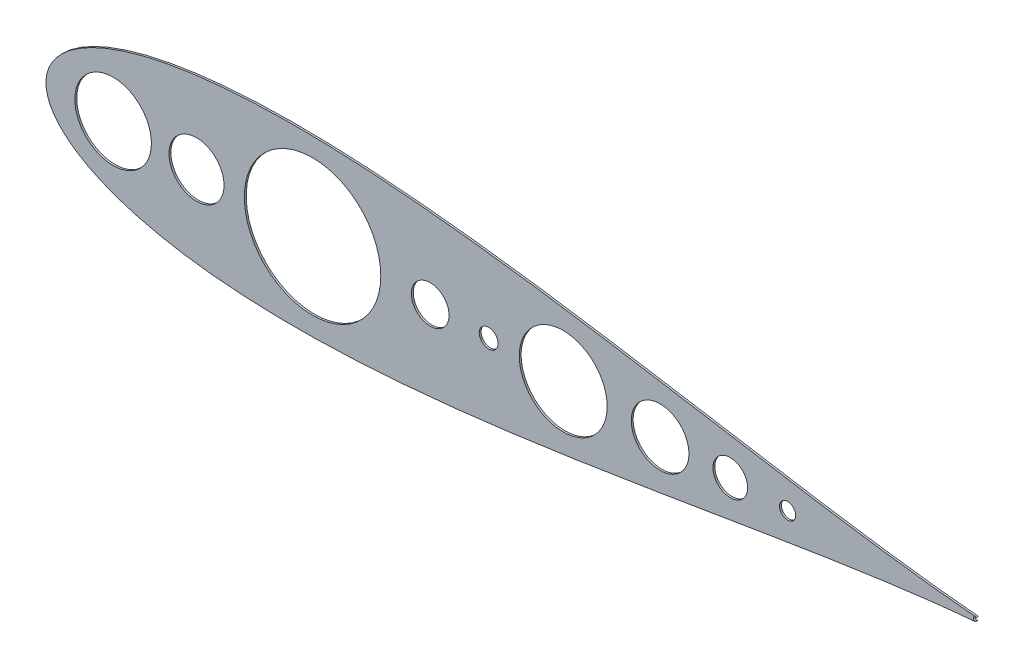
ISO-10303-21;
HEADER;
FILE_DESCRIPTION(('STEP AP214'),'2;1');
FILE_NAME('part.step','',(''),(''),'','','');
FILE_SCHEMA(('AUTOMOTIVE_DESIGN { 1 0 10303 214 1 1 1 1 }'));
ENDSEC;
DATA;
#1=APPLICATION_CONTEXT('core data for automotive mechanical design processes');
#2=APPLICATION_PROTOCOL_DEFINITION('international standard','automotive_design',2000,#1);
#3=PRODUCT_CONTEXT('',#1,'mechanical');
#4=PRODUCT('Part','Part','',(#3));
#5=PRODUCT_RELATED_PRODUCT_CATEGORY('part','',(#4));
#6=PRODUCT_DEFINITION_FORMATION('','',#4);
#7=PRODUCT_DEFINITION_CONTEXT('part definition',#1,'design');
#8=PRODUCT_DEFINITION('design','',#6,#7);
#9=PRODUCT_DEFINITION_SHAPE('','',#8);
#10=(LENGTH_UNIT() NAMED_UNIT(*) SI_UNIT(.MILLI.,.METRE.));
#11=(NAMED_UNIT(*) PLANE_ANGLE_UNIT() SI_UNIT($,.RADIAN.));
#12=(NAMED_UNIT(*) SI_UNIT($,.STERADIAN.) SOLID_ANGLE_UNIT());
#13=UNCERTAINTY_MEASURE_WITH_UNIT(LENGTH_MEASURE(1.E-05),#10,'distance_accuracy_value','');
#14=(GEOMETRIC_REPRESENTATION_CONTEXT(3) GLOBAL_UNCERTAINTY_ASSIGNED_CONTEXT((#13)) GLOBAL_UNIT_ASSIGNED_CONTEXT((#10,
#11,#12)) REPRESENTATION_CONTEXT('',''));
#15=CARTESIAN_POINT('',(0.,0.,0.));
#16=DIRECTION('',(0.,0.,1.));
#17=DIRECTION('',(1.,0.,0.));
#18=AXIS2_PLACEMENT_3D('',#15,#16,#17);
#19=CARTESIAN_POINT('',(500.049305034612,1063.59000346621,2.54));
#20=DIRECTION('',(0.,0.,1.));
#21=DIRECTION('',(1.,0.,0.));
#22=AXIS2_PLACEMENT_3D('',#19,#20,#21);
#23=PLANE('',#22);
#24=CARTESIAN_POINT('',(1422.27175930144,1063.5900034736,2.54));
#25=DIRECTION('',(0.,0.,1.));
#26=DIRECTION('',(1.,0.,0.));
#27=AXIS2_PLACEMENT_3D('',#24,#25,#26);
#28=CIRCLE('',#27,23.3714748823286);
#29=CARTESIAN_POINT('',(1445.64323418377,1063.5900034736,2.54));
#30=VERTEX_POINT('',#29);
#31=EDGE_CURVE('E162',#30,#30,#28,.T.);
#32=ORIENTED_EDGE('',*,*,#31,.F.);
#33=EDGE_LOOP('',(#32));
#34=FACE_BOUND('',#33,.T.);
#35=CARTESIAN_POINT('',(1499.51967033744,1063.5900034736,2.54));
#36=DIRECTION('',(0.,0.,1.));
#37=DIRECTION('',(1.,0.,0.));
#38=AXIS2_PLACEMENT_3D('',#35,#36,#37);
#39=CIRCLE('',#38,10.8856480660851);
#40=CARTESIAN_POINT('',(1510.40531840352,1063.5900034736,2.54));
#41=VERTEX_POINT('',#40);
#42=EDGE_CURVE('E150',#41,#41,#39,.T.);
#43=ORIENTED_EDGE('',*,*,#42,.F.);
#44=EDGE_LOOP('',(#43));
#45=FACE_BOUND('',#44,.T.);
#46=CARTESIAN_POINT('',(1197.11761222176,1063.5900034736,2.54));
#47=DIRECTION('',(0.,0.,1.));
#48=DIRECTION('',(1.,0.,0.));
#49=AXIS2_PLACEMENT_3D('',#46,#47,#48);
#50=CIRCLE('',#49,59.2339025280717);
#51=CARTESIAN_POINT('',(1256.35151474983,1063.5900034736,2.54));
#52=VERTEX_POINT('',#51);
#53=EDGE_CURVE('E138',#52,#52,#50,.T.);
#54=ORIENTED_EDGE('',*,*,#53,.F.);
#55=EDGE_LOOP('',(#54));
#56=FACE_BOUND('',#55,.T.);
#57=CARTESIAN_POINT('',(1017.87402502512,1063.5900034736,2.54));
#58=DIRECTION('',(0.,0.,1.));
#59=DIRECTION('',(1.,0.,0.));
#60=AXIS2_PLACEMENT_3D('',#57,#58,#59);
#61=CIRCLE('',#60,25.3999999999999);
#62=CARTESIAN_POINT('',(1043.27402502512,1063.5900034736,2.54));
#63=VERTEX_POINT('',#62);
#64=EDGE_CURVE('E126',#63,#63,#61,.T.);
#65=ORIENTED_EDGE('',*,*,#64,.F.);
#66=EDGE_LOOP('',(#65));
#67=FACE_BOUND('',#66,.T.);
#68=CARTESIAN_POINT('',(1751.66043943975,1066.67181566444,2.54));
#69=CARTESIAN_POINT('',(1750.65243334118,1066.75564105455,2.54));
#70=CARTESIAN_POINT('',(1743.05588801346,1067.39551186792,2.54));
#71=CARTESIAN_POINT('',(1728.09542145046,1068.778278407,2.54));
#72=CARTESIAN_POINT('',(1705.88881896277,1071.08834960384,2.54));
#73=CARTESIAN_POINT('',(1681.26778265673,1073.92303112593,2.54));
#74=CARTESIAN_POINT('',(1654.3248660962,1077.29931626524,2.54));
#75=CARTESIAN_POINT('',(1625.18576961233,1081.22064268064,2.54));
#76=CARTESIAN_POINT('',(1593.97650442542,1085.67821889553,2.54));
#77=CARTESIAN_POINT('',(1560.832217929,1090.64901961654,2.54));
#78=CARTESIAN_POINT('',(1525.89365687964,1096.09768349299,2.54));
#79=CARTESIAN_POINT('',(1489.30719340603,1101.97556098562,2.54));
#80=CARTESIAN_POINT('',(1451.22402467653,1108.22194169277,2.54));
#81=CARTESIAN_POINT('',(1411.79973338156,1114.76481291137,2.54));
#82=CARTESIAN_POINT('',(1371.19378362612,1121.52158994365,2.54));
#83=CARTESIAN_POINT('',(1329.56925371561,1128.40059485321,2.54));
#84=CARTESIAN_POINT('',(1287.09256794052,1135.30215708802,2.54));
#85=CARTESIAN_POINT('',(1243.93335627727,1142.12024730256,2.54));
#86=CARTESIAN_POINT('',(1200.26436245044,1148.74390639913,2.54));
#87=CARTESIAN_POINT('',(1156.2614370389,1155.05921511198,2.54));
#88=CARTESIAN_POINT('',(1112.10351688426,1160.95073937395,2.54));
#89=CARTESIAN_POINT('',(1067.97266852198,1166.30358781338,2.54));
#90=CARTESIAN_POINT('',(1024.05411842068,1171.00506303685,2.54));
#91=CARTESIAN_POINT('',(980.536281284807,1174.94665172472,2.54));
#92=CARTESIAN_POINT('',(937.61074206236,1178.02560756322,2.54));
#93=CARTESIAN_POINT('',(895.47225221825,1180.14687253827,2.54));
#94=CARTESIAN_POINT('',(854.318687370663,1181.22486543105,2.54));
#95=CARTESIAN_POINT('',(814.350979978366,1181.18484412562,2.54));
#96=CARTESIAN_POINT('',(775.773186931503,1179.96332053201,2.54));
#97=CARTESIAN_POINT('',(738.792492742625,1177.51246825248,2.54));
#98=CARTESIAN_POINT('',(703.619811590789,1173.79674752621,2.54));
#99=CARTESIAN_POINT('',(670.470121337841,1168.79940923418,2.54));
#100=CARTESIAN_POINT('',(639.564473004666,1162.51870036804,2.54));
#101=CARTESIAN_POINT('',(611.131491578328,1154.97563735797,2.54));
#102=CARTESIAN_POINT('',(585.411550069506,1146.21442825848,2.54));
#103=CARTESIAN_POINT('',(562.661229959955,1136.31313691401,2.54));
#104=CARTESIAN_POINT('',(543.156806201734,1125.40287846623,2.54));
#105=CARTESIAN_POINT('',(527.189666059195,1113.7050542486,2.54));
#106=CARTESIAN_POINT('',(515.028677955376,1101.60173193317,2.54));
#107=CARTESIAN_POINT('',(506.795494630954,1089.73285387765,2.54));
#108=CARTESIAN_POINT('',(502.204442161913,1079.02476608504,2.54));
#109=CARTESIAN_POINT('',(500.350488395518,1070.43487927237,2.54));
#110=CARTESIAN_POINT('',(499.928233722474,1063.5900034662,2.54));
#111=CARTESIAN_POINT('',(500.350488395518,1056.74512766004,2.54));
#112=CARTESIAN_POINT('',(502.204442161913,1048.15524084736,2.54));
#113=CARTESIAN_POINT('',(506.795494630954,1037.44715305476,2.54));
#114=CARTESIAN_POINT('',(515.028677955376,1025.57827499924,2.54));
#115=CARTESIAN_POINT('',(527.189666059195,1013.47495268381,2.54));
#116=CARTESIAN_POINT('',(543.156806201734,1001.77712846617,2.54));
#117=CARTESIAN_POINT('',(562.661229959955,990.866870018402,2.54));
#118=CARTESIAN_POINT('',(585.411550069506,980.965578673926,2.54));
#119=CARTESIAN_POINT('',(611.131491578327,972.204369574443,2.54));
#120=CARTESIAN_POINT('',(639.564473004666,964.661306564369,2.54));
#121=CARTESIAN_POINT('',(670.470121337841,958.38059769823,2.54));
#122=CARTESIAN_POINT('',(703.619811590789,953.383259406194,2.54));
#123=CARTESIAN_POINT('',(738.792492742625,949.667538679925,2.54));
#124=CARTESIAN_POINT('',(775.773186931502,947.216686400395,2.54));
#125=CARTESIAN_POINT('',(814.350979978367,945.995162806786,2.54));
#126=CARTESIAN_POINT('',(854.318687370663,945.955141501355,2.54));
#127=CARTESIAN_POINT('',(895.47225221825,947.033134394141,2.54));
#128=CARTESIAN_POINT('',(937.61074206236,949.154399369186,2.54));
#129=CARTESIAN_POINT('',(980.536281284807,952.233355207692,2.54));
#130=CARTESIAN_POINT('',(1024.05411842068,956.174943895556,2.54));
#131=CARTESIAN_POINT('',(1067.97266852198,960.876419119024,2.54));
#132=CARTESIAN_POINT('',(1112.10351688426,966.229267558463,2.54));
#133=CARTESIAN_POINT('',(1156.2614370389,972.120791820431,2.54));
#134=CARTESIAN_POINT('',(1200.26436245044,978.43610053328,2.54));
#135=CARTESIAN_POINT('',(1243.93335627727,985.059759629847,2.54));
#136=CARTESIAN_POINT('',(1287.09256794052,991.87784984439,2.54));
#137=CARTESIAN_POINT('',(1329.56925371561,998.779412079195,2.54));
#138=CARTESIAN_POINT('',(1371.19378362612,1005.65841698876,2.54));
#139=CARTESIAN_POINT('',(1411.79973338156,1012.41519402104,2.54));
#140=CARTESIAN_POINT('',(1451.22402467653,1018.95806523964,2.54));
#141=CARTESIAN_POINT('',(1489.30719340603,1025.20444594679,2.54));
#142=CARTESIAN_POINT('',(1525.89365687964,1031.08232343942,2.54));
#143=CARTESIAN_POINT('',(1560.832217929,1036.53098731587,2.54));
#144=CARTESIAN_POINT('',(1593.97650442542,1041.50178803688,2.54));
#145=CARTESIAN_POINT('',(1625.18576961233,1045.95936425177,2.54));
#146=CARTESIAN_POINT('',(1654.3248660962,1049.88069066717,2.54));
#147=CARTESIAN_POINT('',(1681.26778265673,1053.25697580648,2.54));
#148=CARTESIAN_POINT('',(1705.88881896277,1056.09165732857,2.54));
#149=CARTESIAN_POINT('',(1728.09542145046,1058.40172852541,2.54));
#150=CARTESIAN_POINT('',(1743.05588801346,1059.78449506449,2.54));
#151=CARTESIAN_POINT('',(1750.65243334118,1060.42436587786,2.54));
#152=CARTESIAN_POINT('',(1751.66043943975,1060.50819128276,2.54));
#153=B_SPLINE_CURVE_WITH_KNOTS('',3,(#68,#69,#70,#71,#72,#73,#74,#75,#76,#77,#78,#79,#80,#81,
#82,#83,#84,#85,#86,#87,#88,#89,#90,#91,#92,#93,#94,#95,#96,#97,#98,#99,#100,#101,#102,#103,
#104,#105,#106,#107,#108,#109,#110,#111,#112,#113,#114,#115,#116,#117,#118,#119,#120,#121,#122,
#123,#124,#125,#126,#127,#128,#129,#130,#131,#132,#133,#134,#135,#136,#137,#138,#139,#140,#141,
#142,#143,#144,#145,#146,#147,#148,#149,#150,#151,#152),.UNSPECIFIED.,.F.,.F.,(4,1,1,1,1,1,1,1,
1,1,1,1,1,1,1,1,1,1,1,1,1,1,1,1,1,1,1,1,1,1,1,1,1,1,1,1,1,1,1,1,1,1,1,1,1,1,1,1,1,1,1,1,1,1,1,1,
1,1,1,1,1,1,1,1,1,1,1,1,1,1,1,1,1,1,1,1,1,1,1,1,1,1,4),(0.020157042076269,0.0212708876900959,
0.0285525550130683,0.0367806836725549,0.0459201019032637,0.0559317636633187,0.0667728836144854,
0.0783971303496518,0.0907548266908363,0.103793164577546,0.117456431914319,0.131686225652521,
0.146421738497113,0.161599998000845,0.177156132626574,0.193023668070302,0.209134785631037,
0.225420632511523,0.241811601924249,0.258237646860869,0.274628556698349,0.290914287398014,
0.307025228908797,0.322892517177238,0.33844834182358,0.353626206573582,0.368361231970712,
0.382590427827798,0.396252960572084,0.40929041186716,0.421647009590257,0.433269881487031,
0.444109248914041,0.454118639688981,0.463255054987312,0.471479113777303,0.478755288570903,
0.485052318112802,0.490344025694165,0.494609832614287,0.497833231437255,0.5,0.502166768562745,
0.505390167385713,0.509655974305835,0.514947681887198,0.521244711429097,0.528520886222697,
0.536744945012688,0.545881360311019,0.555890751085959,0.566730118512969,0.578352990409744,
0.59070958813284,0.603747039427916,0.617409572172202,0.631638768029288,0.646373793426418,
0.66155165817642,0.677107482822761,0.692974771091203,0.709085712601986,0.725371443301651,
0.741762353139131,0.758188398075751,0.774579367488477,0.790865214368963,0.806976331929698,
0.822843867373426,0.838400001999155,0.853578261502887,0.868313774347479,0.882543568085681,
0.896206835422454,0.909245173309164,0.921602869650348,0.933227116385514,0.944068236336681,
0.954079898096736,0.963219316327445,0.971447444986932,0.978729112309904,0.979842957923731),.UNSPECIFIED.);
#154=CARTESIAN_POINT('',(1751.66043943975,1066.67181566444,2.54));
#155=VERTEX_POINT('',#154);
#156=CARTESIAN_POINT('',(1751.66043943975,1060.50819128276,2.54));
#157=VERTEX_POINT('',#156);
#158=EDGE_CURVE('E86',#155,#157,#153,.T.);
#159=ORIENTED_EDGE('',*,*,#158,.T.);
#160=CARTESIAN_POINT('',(1751.4041571288,1063.5900034736,2.54));
#161=DIRECTION('',(0.,0.,1.));
#162=DIRECTION('',(1.,0.,0.));
#163=AXIS2_PLACEMENT_3D('',#160,#161,#162);
#164=CIRCLE('',#163,3.09244999999994);
#165=CARTESIAN_POINT('',(1753.59146125329,1061.40392303833,2.54));
#166=VERTEX_POINT('',#165);
#167=EDGE_CURVE('E81',#157,#166,#164,.T.);
#168=ORIENTED_EDGE('',*,*,#167,.T.);
#169=CARTESIAN_POINT('',(1752.37468027854,1063.5900034736,2.54));
#170=DIRECTION('',(0.,0.,-1.));
#171=DIRECTION('',(1.,0.,0.));
#172=AXIS2_PLACEMENT_3D('',#169,#170,#171);
#173=CIRCLE('',#172,2.50189999999974);
#174=CARTESIAN_POINT('',(1753.59146125329,1065.77608390887,2.54));
#175=VERTEX_POINT('',#174);
#176=EDGE_CURVE('E84',#166,#175,#173,.T.);
#177=ORIENTED_EDGE('',*,*,#176,.T.);
#178=CARTESIAN_POINT('',(1751.4041571288,1063.5900034736,2.54));
#179=DIRECTION('',(0.,0.,1.));
#180=DIRECTION('',(1.,0.,0.));
#181=AXIS2_PLACEMENT_3D('',#178,#179,#180);
#182=CIRCLE('',#181,3.09244999999994);
#183=EDGE_CURVE('E51',#175,#155,#182,.T.);
#184=ORIENTED_EDGE('',*,*,#183,.T.);
#185=EDGE_LOOP('',(#159,#168,#177,#184));
#186=FACE_BOUND('',#185,.T.);
#187=CARTESIAN_POINT('',(590.53253796736,1063.5900034736,2.54));
#188=DIRECTION('',(0.,0.,1.));
#189=DIRECTION('',(1.,0.,0.));
#190=AXIS2_PLACEMENT_3D('',#187,#188,#189);
#191=CIRCLE('',#190,51.572420781952);
#192=CARTESIAN_POINT('',(642.104958749312,1063.5900034736,2.54));
#193=VERTEX_POINT('',#192);
#194=EDGE_CURVE('E102',#193,#193,#191,.T.);
#195=ORIENTED_EDGE('',*,*,#194,.F.);
#196=EDGE_LOOP('',(#195));
#197=FACE_BOUND('',#196,.T.);
#198=CARTESIAN_POINT('',(1327.69021036992,1063.5900034736,2.54));
#199=DIRECTION('',(0.,0.,1.));
#200=DIRECTION('',(1.,0.,0.));
#201=AXIS2_PLACEMENT_3D('',#198,#199,#200);
#202=CIRCLE('',#201,38.8398672377173);
#203=CARTESIAN_POINT('',(1366.53007760764,1063.5900034736,2.54));
#204=VERTEX_POINT('',#203);
#205=EDGE_CURVE('E132',#204,#204,#202,.T.);
#206=ORIENTED_EDGE('',*,*,#205,.F.);
#207=EDGE_LOOP('',(#206));
#208=FACE_BOUND('',#207,.T.);
#209=CARTESIAN_POINT('',(859.2920161344,1063.5900034736,2.54));
#210=DIRECTION('',(0.,0.,1.));
#211=DIRECTION('',(1.,0.,0.));
#212=AXIS2_PLACEMENT_3D('',#209,#210,#211);
#213=CIRCLE('',#212,91.963345756037);
#214=CARTESIAN_POINT('',(951.255361890437,1063.5900034736,2.54));
#215=VERTEX_POINT('',#214);
#216=EDGE_CURVE('E144',#215,#215,#213,.T.);
#217=ORIENTED_EDGE('',*,*,#216,.F.);
#218=EDGE_LOOP('',(#217));
#219=FACE_BOUND('',#218,.T.);
#220=CARTESIAN_POINT('',(702.91402502512,1063.5900034736,2.54));
#221=DIRECTION('',(0.,0.,1.));
#222=DIRECTION('',(1.,0.,0.));
#223=AXIS2_PLACEMENT_3D('',#220,#221,#222);
#224=CIRCLE('',#223,37.0840000000001);
#225=CARTESIAN_POINT('',(739.99802502512,1063.5900034736,2.54));
#226=VERTEX_POINT('',#225);
#227=EDGE_CURVE('E156',#226,#226,#224,.T.);
#228=ORIENTED_EDGE('',*,*,#227,.F.);
#229=EDGE_LOOP('',(#228));
#230=FACE_BOUND('',#229,.T.);
#231=CARTESIAN_POINT('',(1096.61402502512,1063.5900034736,2.54));
#232=DIRECTION('',(0.,0.,1.));
#233=DIRECTION('',(1.,0.,0.));
#234=AXIS2_PLACEMENT_3D('',#231,#232,#233);
#235=CIRCLE('',#234,12.7000000000002);
#236=CARTESIAN_POINT('',(1109.31402502512,1063.5900034736,2.54));
#237=VERTEX_POINT('',#236);
#238=EDGE_CURVE('E168',#237,#237,#235,.T.);
#239=ORIENTED_EDGE('',*,*,#238,.F.);
#240=EDGE_LOOP('',(#239));
#241=FACE_BOUND('',#240,.T.);
#242=ADVANCED_FACE('F33',(#34,#45,#56,#67,#186,#197,#208,#219,#230,#241),#23,.T.);
#243=CARTESIAN_POINT('',(500.049305034612,1063.59000346621,0.));
#244=DIRECTION('',(0.,0.,1.));
#245=DIRECTION('',(1.,0.,0.));
#246=AXIS2_PLACEMENT_3D('',#243,#244,#245);
#247=PLANE('',#246);
#248=CARTESIAN_POINT('',(1751.66043943975,1066.67181566444,0.));
#249=CARTESIAN_POINT('',(1750.65243334118,1066.75564105455,0.));
#250=CARTESIAN_POINT('',(1743.05588801346,1067.39551186792,0.));
#251=CARTESIAN_POINT('',(1728.09542145046,1068.778278407,0.));
#252=CARTESIAN_POINT('',(1705.88881896277,1071.08834960384,0.));
#253=CARTESIAN_POINT('',(1681.26778265673,1073.92303112593,0.));
#254=CARTESIAN_POINT('',(1654.3248660962,1077.29931626524,0.));
#255=CARTESIAN_POINT('',(1625.18576961233,1081.22064268064,0.));
#256=CARTESIAN_POINT('',(1593.97650442542,1085.67821889553,0.));
#257=CARTESIAN_POINT('',(1560.832217929,1090.64901961654,0.));
#258=CARTESIAN_POINT('',(1525.89365687964,1096.09768349299,0.));
#259=CARTESIAN_POINT('',(1489.30719340603,1101.97556098562,0.));
#260=CARTESIAN_POINT('',(1451.22402467653,1108.22194169277,0.));
#261=CARTESIAN_POINT('',(1411.79973338156,1114.76481291137,0.));
#262=CARTESIAN_POINT('',(1371.19378362612,1121.52158994365,0.));
#263=CARTESIAN_POINT('',(1329.56925371561,1128.40059485321,0.));
#264=CARTESIAN_POINT('',(1287.09256794052,1135.30215708802,0.));
#265=CARTESIAN_POINT('',(1243.93335627727,1142.12024730256,0.));
#266=CARTESIAN_POINT('',(1200.26436245044,1148.74390639913,0.));
#267=CARTESIAN_POINT('',(1156.2614370389,1155.05921511198,0.));
#268=CARTESIAN_POINT('',(1112.10351688426,1160.95073937395,0.));
#269=CARTESIAN_POINT('',(1067.97266852198,1166.30358781338,0.));
#270=CARTESIAN_POINT('',(1024.05411842068,1171.00506303685,0.));
#271=CARTESIAN_POINT('',(980.536281284807,1174.94665172472,0.));
#272=CARTESIAN_POINT('',(937.61074206236,1178.02560756322,0.));
#273=CARTESIAN_POINT('',(895.47225221825,1180.14687253827,0.));
#274=CARTESIAN_POINT('',(854.318687370663,1181.22486543105,0.));
#275=CARTESIAN_POINT('',(814.350979978366,1181.18484412562,0.));
#276=CARTESIAN_POINT('',(775.773186931503,1179.96332053201,0.));
#277=CARTESIAN_POINT('',(738.792492742625,1177.51246825248,0.));
#278=CARTESIAN_POINT('',(703.619811590789,1173.79674752621,0.));
#279=CARTESIAN_POINT('',(670.470121337841,1168.79940923418,0.));
#280=CARTESIAN_POINT('',(639.564473004666,1162.51870036804,0.));
#281=CARTESIAN_POINT('',(611.131491578328,1154.97563735797,0.));
#282=CARTESIAN_POINT('',(585.411550069506,1146.21442825848,0.));
#283=CARTESIAN_POINT('',(562.661229959955,1136.31313691401,0.));
#284=CARTESIAN_POINT('',(543.156806201734,1125.40287846623,0.));
#285=CARTESIAN_POINT('',(527.189666059195,1113.7050542486,0.));
#286=CARTESIAN_POINT('',(515.028677955376,1101.60173193317,0.));
#287=CARTESIAN_POINT('',(506.795494630954,1089.73285387765,0.));
#288=CARTESIAN_POINT('',(502.204442161913,1079.02476608504,0.));
#289=CARTESIAN_POINT('',(500.350488395518,1070.43487927237,0.));
#290=CARTESIAN_POINT('',(499.928233722474,1063.5900034662,0.));
#291=CARTESIAN_POINT('',(500.350488395518,1056.74512766004,0.));
#292=CARTESIAN_POINT('',(502.204442161913,1048.15524084736,0.));
#293=CARTESIAN_POINT('',(506.795494630954,1037.44715305476,0.));
#294=CARTESIAN_POINT('',(515.028677955376,1025.57827499924,0.));
#295=CARTESIAN_POINT('',(527.189666059195,1013.47495268381,0.));
#296=CARTESIAN_POINT('',(543.156806201734,1001.77712846617,0.));
#297=CARTESIAN_POINT('',(562.661229959955,990.866870018402,0.));
#298=CARTESIAN_POINT('',(585.411550069506,980.965578673926,0.));
#299=CARTESIAN_POINT('',(611.131491578327,972.204369574443,0.));
#300=CARTESIAN_POINT('',(639.564473004666,964.661306564369,0.));
#301=CARTESIAN_POINT('',(670.470121337841,958.38059769823,0.));
#302=CARTESIAN_POINT('',(703.619811590789,953.383259406194,0.));
#303=CARTESIAN_POINT('',(738.792492742625,949.667538679925,0.));
#304=CARTESIAN_POINT('',(775.773186931502,947.216686400395,0.));
#305=CARTESIAN_POINT('',(814.350979978367,945.995162806786,0.));
#306=CARTESIAN_POINT('',(854.318687370663,945.955141501355,0.));
#307=CARTESIAN_POINT('',(895.47225221825,947.033134394141,0.));
#308=CARTESIAN_POINT('',(937.61074206236,949.154399369186,0.));
#309=CARTESIAN_POINT('',(980.536281284807,952.233355207692,0.));
#310=CARTESIAN_POINT('',(1024.05411842068,956.174943895556,0.));
#311=CARTESIAN_POINT('',(1067.97266852198,960.876419119024,0.));
#312=CARTESIAN_POINT('',(1112.10351688426,966.229267558463,0.));
#313=CARTESIAN_POINT('',(1156.2614370389,972.120791820431,0.));
#314=CARTESIAN_POINT('',(1200.26436245044,978.43610053328,0.));
#315=CARTESIAN_POINT('',(1243.93335627727,985.059759629847,0.));
#316=CARTESIAN_POINT('',(1287.09256794052,991.87784984439,0.));
#317=CARTESIAN_POINT('',(1329.56925371561,998.779412079195,0.));
#318=CARTESIAN_POINT('',(1371.19378362612,1005.65841698876,0.));
#319=CARTESIAN_POINT('',(1411.79973338156,1012.41519402104,0.));
#320=CARTESIAN_POINT('',(1451.22402467653,1018.95806523964,0.));
#321=CARTESIAN_POINT('',(1489.30719340603,1025.20444594679,0.));
#322=CARTESIAN_POINT('',(1525.89365687964,1031.08232343942,0.));
#323=CARTESIAN_POINT('',(1560.832217929,1036.53098731587,0.));
#324=CARTESIAN_POINT('',(1593.97650442542,1041.50178803688,0.));
#325=CARTESIAN_POINT('',(1625.18576961233,1045.95936425177,0.));
#326=CARTESIAN_POINT('',(1654.3248660962,1049.88069066717,0.));
#327=CARTESIAN_POINT('',(1681.26778265673,1053.25697580648,0.));
#328=CARTESIAN_POINT('',(1705.88881896277,1056.09165732857,0.));
#329=CARTESIAN_POINT('',(1728.09542145046,1058.40172852541,0.));
#330=CARTESIAN_POINT('',(1743.05588801346,1059.78449506449,0.));
#331=CARTESIAN_POINT('',(1750.65243334118,1060.42436587786,0.));
#332=CARTESIAN_POINT('',(1751.66043943975,1060.50819128276,0.));
#333=B_SPLINE_CURVE_WITH_KNOTS('',3,(#248,#249,#250,#251,#252,#253,#254,#255,#256,#257,#258,
#259,#260,#261,#262,#263,#264,#265,#266,#267,#268,#269,#270,#271,#272,#273,#274,#275,#276,#277,
#278,#279,#280,#281,#282,#283,#284,#285,#286,#287,#288,#289,#290,#291,#292,#293,#294,#295,#296,
#297,#298,#299,#300,#301,#302,#303,#304,#305,#306,#307,#308,#309,#310,#311,#312,#313,#314,#315,
#316,#317,#318,#319,#320,#321,#322,#323,#324,#325,#326,#327,#328,#329,#330,#331,#332),
.UNSPECIFIED.,.F.,.F.,(4,1,1,1,1,1,1,1,1,1,1,1,1,1,1,1,1,1,1,1,1,1,1,1,1,1,1,1,1,1,1,1,1,1,1,1,
1,1,1,1,1,1,1,1,1,1,1,1,1,1,1,1,1,1,1,1,1,1,1,1,1,1,1,1,1,1,1,1,1,1,1,1,1,1,1,1,1,1,1,1,1,1,4),
(0.020157042076269,0.0212708876900959,0.0285525550130683,0.0367806836725549,0.0459201019032637,
0.0559317636633187,0.0667728836144854,0.0783971303496518,0.0907548266908363,0.103793164577546,
0.117456431914319,0.131686225652521,0.146421738497113,0.161599998000845,0.177156132626574,
0.193023668070302,0.209134785631037,0.225420632511523,0.241811601924249,0.258237646860869,
0.274628556698349,0.290914287398014,0.307025228908797,0.322892517177238,0.33844834182358,
0.353626206573582,0.368361231970712,0.382590427827798,0.396252960572084,0.40929041186716,
0.421647009590257,0.433269881487031,0.444109248914041,0.454118639688981,0.463255054987312,
0.471479113777303,0.478755288570903,0.485052318112802,0.490344025694165,0.494609832614287,
0.497833231437255,0.5,0.502166768562745,0.505390167385713,0.509655974305835,0.514947681887198,
0.521244711429097,0.528520886222697,0.536744945012688,0.545881360311019,0.555890751085959,
0.566730118512969,0.578352990409744,0.59070958813284,0.603747039427916,0.617409572172202,
0.631638768029288,0.646373793426418,0.66155165817642,0.677107482822761,0.692974771091203,
0.709085712601986,0.725371443301651,0.741762353139131,0.758188398075751,0.774579367488477,
0.790865214368963,0.806976331929698,0.822843867373426,0.838400001999155,0.853578261502887,
0.868313774347479,0.882543568085681,0.896206835422454,0.909245173309164,0.921602869650348,
0.933227116385514,0.944068236336681,0.954079898096736,0.963219316327445,0.971447444986932,
0.978729112309904,0.979842957923731),.UNSPECIFIED.);
#334=CARTESIAN_POINT('',(1751.66043943975,1066.67181566444,0.));
#335=VERTEX_POINT('',#334);
#336=CARTESIAN_POINT('',(1751.66043943975,1060.50819128276,0.));
#337=VERTEX_POINT('',#336);
#338=EDGE_CURVE('E97',#335,#337,#333,.T.);
#339=ORIENTED_EDGE('',*,*,#338,.F.);
#340=CARTESIAN_POINT('',(1751.4041571288,1063.5900034736,0.));
#341=DIRECTION('',(0.,0.,1.));
#342=DIRECTION('',(1.,0.,0.));
#343=AXIS2_PLACEMENT_3D('',#340,#341,#342);
#344=CIRCLE('',#343,3.09244999999994);
#345=CARTESIAN_POINT('',(1753.59146125329,1065.77608390887,0.));
#346=VERTEX_POINT('',#345);
#347=EDGE_CURVE('E74',#346,#335,#344,.T.);
#348=ORIENTED_EDGE('',*,*,#347,.F.);
#349=CARTESIAN_POINT('',(1752.37468027854,1063.5900034736,0.));
#350=DIRECTION('',(0.,0.,-1.));
#351=DIRECTION('',(1.,0.,0.));
#352=AXIS2_PLACEMENT_3D('',#349,#350,#351);
#353=CIRCLE('',#352,2.50189999999974);
#354=CARTESIAN_POINT('',(1753.59146125329,1061.40392303833,0.));
#355=VERTEX_POINT('',#354);
#356=EDGE_CURVE('E68',#355,#346,#353,.T.);
#357=ORIENTED_EDGE('',*,*,#356,.F.);
#358=CARTESIAN_POINT('',(1751.4041571288,1063.5900034736,0.));
#359=DIRECTION('',(0.,0.,1.));
#360=DIRECTION('',(1.,0.,0.));
#361=AXIS2_PLACEMENT_3D('',#358,#359,#360);
#362=CIRCLE('',#361,3.09244999999994);
#363=EDGE_CURVE('E90',#337,#355,#362,.T.);
#364=ORIENTED_EDGE('',*,*,#363,.F.);
#365=EDGE_LOOP('',(#339,#348,#357,#364));
#366=FACE_BOUND('',#365,.T.);
#367=CARTESIAN_POINT('',(590.53253796736,1063.5900034736,0.));
#368=DIRECTION('',(0.,0.,1.));
#369=DIRECTION('',(1.,0.,0.));
#370=AXIS2_PLACEMENT_3D('',#367,#368,#369);
#371=CIRCLE('',#370,51.572420781952);
#372=CARTESIAN_POINT('',(642.104958749312,1063.5900034736,0.));
#373=VERTEX_POINT('',#372);
#374=EDGE_CURVE('E120',#373,#373,#371,.T.);
#375=ORIENTED_EDGE('',*,*,#374,.T.);
#376=EDGE_LOOP('',(#375));
#377=FACE_BOUND('',#376,.T.);
#378=CARTESIAN_POINT('',(1017.87402502512,1063.5900034736,0.));
#379=DIRECTION('',(0.,0.,1.));
#380=DIRECTION('',(1.,0.,0.));
#381=AXIS2_PLACEMENT_3D('',#378,#379,#380);
#382=CIRCLE('',#381,25.3999999999999);
#383=CARTESIAN_POINT('',(1043.27402502512,1063.5900034736,0.));
#384=VERTEX_POINT('',#383);
#385=EDGE_CURVE('E129',#384,#384,#382,.T.);
#386=ORIENTED_EDGE('',*,*,#385,.T.);
#387=EDGE_LOOP('',(#386));
#388=FACE_BOUND('',#387,.T.);
#389=CARTESIAN_POINT('',(1327.69021036992,1063.5900034736,0.));
#390=DIRECTION('',(0.,0.,1.));
#391=DIRECTION('',(1.,0.,0.));
#392=AXIS2_PLACEMENT_3D('',#389,#390,#391);
#393=CIRCLE('',#392,38.8398672377173);
#394=CARTESIAN_POINT('',(1366.53007760764,1063.5900034736,0.));
#395=VERTEX_POINT('',#394);
#396=EDGE_CURVE('E135',#395,#395,#393,.T.);
#397=ORIENTED_EDGE('',*,*,#396,.T.);
#398=EDGE_LOOP('',(#397));
#399=FACE_BOUND('',#398,.T.);
#400=CARTESIAN_POINT('',(1197.11761222176,1063.5900034736,0.));
#401=DIRECTION('',(0.,0.,1.));
#402=DIRECTION('',(1.,0.,0.));
#403=AXIS2_PLACEMENT_3D('',#400,#401,#402);
#404=CIRCLE('',#403,59.2339025280717);
#405=CARTESIAN_POINT('',(1256.35151474983,1063.5900034736,0.));
#406=VERTEX_POINT('',#405);
#407=EDGE_CURVE('E141',#406,#406,#404,.T.);
#408=ORIENTED_EDGE('',*,*,#407,.T.);
#409=EDGE_LOOP('',(#408));
#410=FACE_BOUND('',#409,.T.);
#411=CARTESIAN_POINT('',(859.2920161344,1063.5900034736,0.));
#412=DIRECTION('',(0.,0.,1.));
#413=DIRECTION('',(1.,0.,0.));
#414=AXIS2_PLACEMENT_3D('',#411,#412,#413);
#415=CIRCLE('',#414,91.963345756037);
#416=CARTESIAN_POINT('',(951.255361890437,1063.5900034736,0.));
#417=VERTEX_POINT('',#416);
#418=EDGE_CURVE('E147',#417,#417,#415,.T.);
#419=ORIENTED_EDGE('',*,*,#418,.T.);
#420=EDGE_LOOP('',(#419));
#421=FACE_BOUND('',#420,.T.);
#422=CARTESIAN_POINT('',(1499.51967033744,1063.5900034736,0.));
#423=DIRECTION('',(0.,0.,1.));
#424=DIRECTION('',(1.,0.,0.));
#425=AXIS2_PLACEMENT_3D('',#422,#423,#424);
#426=CIRCLE('',#425,10.8856480660851);
#427=CARTESIAN_POINT('',(1510.40531840352,1063.5900034736,0.));
#428=VERTEX_POINT('',#427);
#429=EDGE_CURVE('E153',#428,#428,#426,.T.);
#430=ORIENTED_EDGE('',*,*,#429,.T.);
#431=EDGE_LOOP('',(#430));
#432=FACE_BOUND('',#431,.T.);
#433=CARTESIAN_POINT('',(702.91402502512,1063.5900034736,0.));
#434=DIRECTION('',(0.,0.,1.));
#435=DIRECTION('',(1.,0.,0.));
#436=AXIS2_PLACEMENT_3D('',#433,#434,#435);
#437=CIRCLE('',#436,37.0840000000001);
#438=CARTESIAN_POINT('',(739.99802502512,1063.5900034736,0.));
#439=VERTEX_POINT('',#438);
#440=EDGE_CURVE('E159',#439,#439,#437,.T.);
#441=ORIENTED_EDGE('',*,*,#440,.T.);
#442=EDGE_LOOP('',(#441));
#443=FACE_BOUND('',#442,.T.);
#444=CARTESIAN_POINT('',(1422.27175930144,1063.5900034736,0.));
#445=DIRECTION('',(0.,0.,1.));
#446=DIRECTION('',(1.,0.,0.));
#447=AXIS2_PLACEMENT_3D('',#444,#445,#446);
#448=CIRCLE('',#447,23.3714748823286);
#449=CARTESIAN_POINT('',(1445.64323418377,1063.5900034736,0.));
#450=VERTEX_POINT('',#449);
#451=EDGE_CURVE('E165',#450,#450,#448,.T.);
#452=ORIENTED_EDGE('',*,*,#451,.T.);
#453=EDGE_LOOP('',(#452));
#454=FACE_BOUND('',#453,.T.);
#455=CARTESIAN_POINT('',(1096.61402502512,1063.5900034736,0.));
#456=DIRECTION('',(0.,0.,1.));
#457=DIRECTION('',(1.,0.,0.));
#458=AXIS2_PLACEMENT_3D('',#455,#456,#457);
#459=CIRCLE('',#458,12.7000000000002);
#460=CARTESIAN_POINT('',(1109.31402502512,1063.5900034736,0.));
#461=VERTEX_POINT('',#460);
#462=EDGE_CURVE('E171',#461,#461,#459,.T.);
#463=ORIENTED_EDGE('',*,*,#462,.T.);
#464=EDGE_LOOP('',(#463));
#465=FACE_BOUND('',#464,.T.);
#466=ADVANCED_FACE('F113',(#366,#377,#388,#399,#410,#421,#432,#443,#454,#465),#247,.F.);
#467=DIRECTION('',(0.,0.,-1.));
#468=VECTOR('',#467,1.);
#469=SURFACE_OF_LINEAR_EXTRUSION('',#153,#468);
#470=ORIENTED_EDGE('',*,*,#338,.T.);
#471=DIRECTION('',(0.,0.,-1.));
#472=VECTOR('',#471,1.);
#473=CARTESIAN_POINT('',(1751.66043943975,1060.50819128276,2.54));
#474=LINE('',#473,#472);
#475=EDGE_CURVE('E11',#157,#337,#474,.T.);
#476=ORIENTED_EDGE('',*,*,#475,.F.);
#477=ORIENTED_EDGE('',*,*,#158,.F.);
#478=DIRECTION('',(0.,0.,-1.));
#479=VECTOR('',#478,1.);
#480=CARTESIAN_POINT('',(1751.66043943975,1066.67181566444,2.54));
#481=LINE('',#480,#479);
#482=EDGE_CURVE('E94',#155,#335,#481,.T.);
#483=ORIENTED_EDGE('',*,*,#482,.T.);
#484=EDGE_LOOP('',(#470,#476,#477,#483));
#485=FACE_BOUND('',#484,.T.);
#486=ADVANCED_FACE('F35',(#485),#469,.F.);
#487=CARTESIAN_POINT('',(1751.4041571288,1063.5900034736,2.54));
#488=DIRECTION('',(0.,0.,-1.));
#489=DIRECTION('',(-1.,0.,0.));
#490=AXIS2_PLACEMENT_3D('',#487,#488,#489);
#491=CYLINDRICAL_SURFACE('',#490,3.09244999999994);
#492=ORIENTED_EDGE('',*,*,#363,.T.);
#493=DIRECTION('',(0.,0.,-1.));
#494=VECTOR('',#493,1.);
#495=CARTESIAN_POINT('',(1753.59146125329,1061.40392303833,2.54));
#496=LINE('',#495,#494);
#497=EDGE_CURVE('E43',#166,#355,#496,.T.);
#498=ORIENTED_EDGE('',*,*,#497,.F.);
#499=ORIENTED_EDGE('',*,*,#167,.F.);
#500=ORIENTED_EDGE('',*,*,#475,.T.);
#501=EDGE_LOOP('',(#492,#498,#499,#500));
#502=FACE_BOUND('',#501,.T.);
#503=ADVANCED_FACE('F89',(#502),#491,.T.);
#504=CARTESIAN_POINT('',(1752.37468027854,1063.5900034736,2.54));
#505=DIRECTION('',(0.,0.,-1.));
#506=DIRECTION('',(-1.,0.,0.));
#507=AXIS2_PLACEMENT_3D('',#504,#505,#506);
#508=CYLINDRICAL_SURFACE('',#507,2.50189999999974);
#509=ORIENTED_EDGE('',*,*,#356,.T.);
#510=DIRECTION('',(0.,0.,-1.));
#511=VECTOR('',#510,1.);
#512=CARTESIAN_POINT('',(1753.59146125329,1065.77608390887,2.54));
#513=LINE('',#512,#511);
#514=EDGE_CURVE('E91',#175,#346,#513,.T.);
#515=ORIENTED_EDGE('',*,*,#514,.F.);
#516=ORIENTED_EDGE('',*,*,#176,.F.);
#517=ORIENTED_EDGE('',*,*,#497,.T.);
#518=EDGE_LOOP('',(#509,#515,#516,#517));
#519=FACE_BOUND('',#518,.T.);
#520=ADVANCED_FACE('F92',(#519),#508,.F.);
#521=CARTESIAN_POINT('',(1751.4041571288,1063.5900034736,2.54));
#522=DIRECTION('',(0.,0.,-1.));
#523=DIRECTION('',(-1.,0.,0.));
#524=AXIS2_PLACEMENT_3D('',#521,#522,#523);
#525=CYLINDRICAL_SURFACE('',#524,3.09244999999994);
#526=ORIENTED_EDGE('',*,*,#347,.T.);
#527=ORIENTED_EDGE('',*,*,#482,.F.);
#528=ORIENTED_EDGE('',*,*,#183,.F.);
#529=ORIENTED_EDGE('',*,*,#514,.T.);
#530=EDGE_LOOP('',(#526,#527,#528,#529));
#531=FACE_BOUND('',#530,.T.);
#532=ADVANCED_FACE('F110',(#531),#525,.T.);
#533=CARTESIAN_POINT('',(590.53253796736,1063.5900034736,2.54));
#534=DIRECTION('',(0.,0.,-1.));
#535=DIRECTION('',(-1.,0.,0.));
#536=AXIS2_PLACEMENT_3D('',#533,#534,#535);
#537=CYLINDRICAL_SURFACE('',#536,51.572420781952);
#538=ORIENTED_EDGE('',*,*,#194,.T.);
#539=EDGE_LOOP('',(#538));
#540=FACE_BOUND('',#539,.T.);
#541=ORIENTED_EDGE('',*,*,#374,.F.);
#542=EDGE_LOOP('',(#541));
#543=FACE_BOUND('',#542,.T.);
#544=ADVANCED_FACE('F190',(#540,#543),#537,.F.);
#545=CARTESIAN_POINT('',(1017.87402502512,1063.5900034736,2.54));
#546=DIRECTION('',(0.,0.,-1.));
#547=DIRECTION('',(-1.,0.,0.));
#548=AXIS2_PLACEMENT_3D('',#545,#546,#547);
#549=CYLINDRICAL_SURFACE('',#548,25.3999999999999);
#550=ORIENTED_EDGE('',*,*,#64,.T.);
#551=EDGE_LOOP('',(#550));
#552=FACE_BOUND('',#551,.T.);
#553=ORIENTED_EDGE('',*,*,#385,.F.);
#554=EDGE_LOOP('',(#553));
#555=FACE_BOUND('',#554,.T.);
#556=ADVANCED_FACE('F236',(#552,#555),#549,.F.);
#557=CARTESIAN_POINT('',(1327.69021036992,1063.5900034736,2.54));
#558=DIRECTION('',(0.,0.,-1.));
#559=DIRECTION('',(-1.,0.,0.));
#560=AXIS2_PLACEMENT_3D('',#557,#558,#559);
#561=CYLINDRICAL_SURFACE('',#560,38.8398672377173);
#562=ORIENTED_EDGE('',*,*,#205,.T.);
#563=EDGE_LOOP('',(#562));
#564=FACE_BOUND('',#563,.T.);
#565=ORIENTED_EDGE('',*,*,#396,.F.);
#566=EDGE_LOOP('',(#565));
#567=FACE_BOUND('',#566,.T.);
#568=ADVANCED_FACE('F244',(#564,#567),#561,.F.);
#569=CARTESIAN_POINT('',(1197.11761222176,1063.5900034736,2.54));
#570=DIRECTION('',(0.,0.,-1.));
#571=DIRECTION('',(-1.,0.,0.));
#572=AXIS2_PLACEMENT_3D('',#569,#570,#571);
#573=CYLINDRICAL_SURFACE('',#572,59.2339025280717);
#574=ORIENTED_EDGE('',*,*,#53,.T.);
#575=EDGE_LOOP('',(#574));
#576=FACE_BOUND('',#575,.T.);
#577=ORIENTED_EDGE('',*,*,#407,.F.);
#578=EDGE_LOOP('',(#577));
#579=FACE_BOUND('',#578,.T.);
#580=ADVANCED_FACE('F252',(#576,#579),#573,.F.);
#581=CARTESIAN_POINT('',(859.2920161344,1063.5900034736,2.54));
#582=DIRECTION('',(0.,0.,-1.));
#583=DIRECTION('',(-1.,0.,0.));
#584=AXIS2_PLACEMENT_3D('',#581,#582,#583);
#585=CYLINDRICAL_SURFACE('',#584,91.963345756037);
#586=ORIENTED_EDGE('',*,*,#216,.T.);
#587=EDGE_LOOP('',(#586));
#588=FACE_BOUND('',#587,.T.);
#589=ORIENTED_EDGE('',*,*,#418,.F.);
#590=EDGE_LOOP('',(#589));
#591=FACE_BOUND('',#590,.T.);
#592=ADVANCED_FACE('F261',(#588,#591),#585,.F.);
#593=CARTESIAN_POINT('',(1499.51967033744,1063.5900034736,2.54));
#594=DIRECTION('',(0.,0.,-1.));
#595=DIRECTION('',(-1.,0.,0.));
#596=AXIS2_PLACEMENT_3D('',#593,#594,#595);
#597=CYLINDRICAL_SURFACE('',#596,10.8856480660851);
#598=ORIENTED_EDGE('',*,*,#42,.T.);
#599=EDGE_LOOP('',(#598));
#600=FACE_BOUND('',#599,.T.);
#601=ORIENTED_EDGE('',*,*,#429,.F.);
#602=EDGE_LOOP('',(#601));
#603=FACE_BOUND('',#602,.T.);
#604=ADVANCED_FACE('F270',(#600,#603),#597,.F.);
#605=CARTESIAN_POINT('',(702.91402502512,1063.5900034736,2.54));
#606=DIRECTION('',(0.,0.,-1.));
#607=DIRECTION('',(-1.,0.,0.));
#608=AXIS2_PLACEMENT_3D('',#605,#606,#607);
#609=CYLINDRICAL_SURFACE('',#608,37.0840000000001);
#610=ORIENTED_EDGE('',*,*,#227,.T.);
#611=EDGE_LOOP('',(#610));
#612=FACE_BOUND('',#611,.T.);
#613=ORIENTED_EDGE('',*,*,#440,.F.);
#614=EDGE_LOOP('',(#613));
#615=FACE_BOUND('',#614,.T.);
#616=ADVANCED_FACE('F279',(#612,#615),#609,.F.);
#617=CARTESIAN_POINT('',(1422.27175930144,1063.5900034736,2.54));
#618=DIRECTION('',(0.,0.,-1.));
#619=DIRECTION('',(-1.,0.,0.));
#620=AXIS2_PLACEMENT_3D('',#617,#618,#619);
#621=CYLINDRICAL_SURFACE('',#620,23.3714748823286);
#622=ORIENTED_EDGE('',*,*,#31,.T.);
#623=EDGE_LOOP('',(#622));
#624=FACE_BOUND('',#623,.T.);
#625=ORIENTED_EDGE('',*,*,#451,.F.);
#626=EDGE_LOOP('',(#625));
#627=FACE_BOUND('',#626,.T.);
#628=ADVANCED_FACE('F288',(#624,#627),#621,.F.);
#629=CARTESIAN_POINT('',(1096.61402502512,1063.5900034736,2.54));
#630=DIRECTION('',(0.,0.,-1.));
#631=DIRECTION('',(-1.,0.,0.));
#632=AXIS2_PLACEMENT_3D('',#629,#630,#631);
#633=CYLINDRICAL_SURFACE('',#632,12.7000000000002);
#634=ORIENTED_EDGE('',*,*,#238,.T.);
#635=EDGE_LOOP('',(#634));
#636=FACE_BOUND('',#635,.T.);
#637=ORIENTED_EDGE('',*,*,#462,.F.);
#638=EDGE_LOOP('',(#637));
#639=FACE_BOUND('',#638,.T.);
#640=ADVANCED_FACE('F177',(#636,#639),#633,.F.);
#641=CLOSED_SHELL('',(#242,#466,#486,#503,#520,#532,#544,#556,#568,#580,#592,#604,#616,#628,#640));
#642=MANIFOLD_SOLID_BREP('B2',#641);
#643=ADVANCED_BREP_SHAPE_REPRESENTATION('',(#18,#642),#14);
#644=SHAPE_DEFINITION_REPRESENTATION(#9,#643);
ENDSEC;
END-ISO-10303-21;
